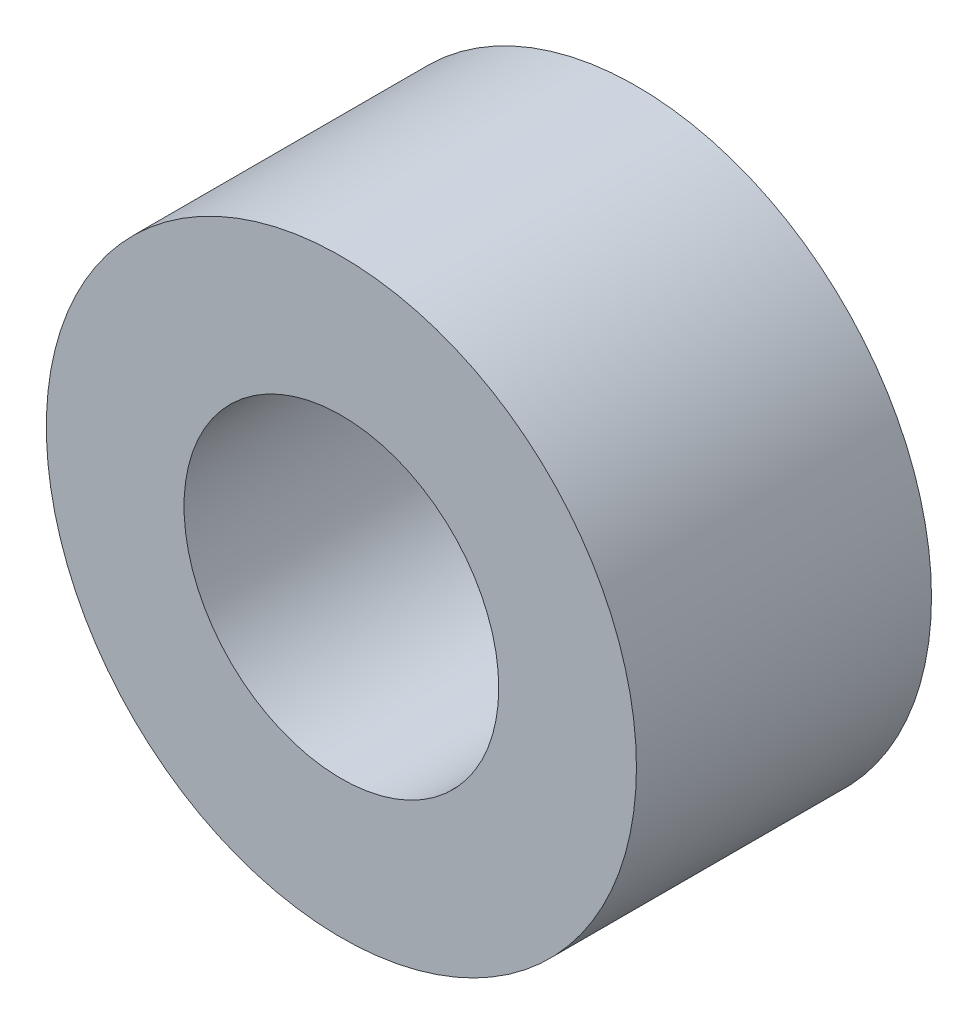
ISO-10303-21;
HEADER;
FILE_DESCRIPTION(('STEP AP214'),'2;1');
FILE_NAME('part.step','',(''),(''),'','','');
FILE_SCHEMA(('AUTOMOTIVE_DESIGN { 1 0 10303 214 1 1 1 1 }'));
ENDSEC;
DATA;
#1=APPLICATION_CONTEXT('core data for automotive mechanical design processes');
#2=APPLICATION_PROTOCOL_DEFINITION('international standard','automotive_design',2000,#1);
#3=PRODUCT_CONTEXT('',#1,'mechanical');
#4=PRODUCT('Part','Part','',(#3));
#5=PRODUCT_RELATED_PRODUCT_CATEGORY('part','',(#4));
#6=PRODUCT_DEFINITION_FORMATION('','',#4);
#7=PRODUCT_DEFINITION_CONTEXT('part definition',#1,'design');
#8=PRODUCT_DEFINITION('design','',#6,#7);
#9=PRODUCT_DEFINITION_SHAPE('','',#8);
#10=(LENGTH_UNIT() NAMED_UNIT(*) SI_UNIT(.MILLI.,.METRE.));
#11=(NAMED_UNIT(*) PLANE_ANGLE_UNIT() SI_UNIT($,.RADIAN.));
#12=(NAMED_UNIT(*) SI_UNIT($,.STERADIAN.) SOLID_ANGLE_UNIT());
#13=UNCERTAINTY_MEASURE_WITH_UNIT(LENGTH_MEASURE(1.E-05),#10,'distance_accuracy_value','');
#14=(GEOMETRIC_REPRESENTATION_CONTEXT(3) GLOBAL_UNCERTAINTY_ASSIGNED_CONTEXT((#13)) GLOBAL_UNIT_ASSIGNED_CONTEXT((#10,
#11,#12)) REPRESENTATION_CONTEXT('',''));
#15=CARTESIAN_POINT('',(0.,0.,0.));
#16=DIRECTION('',(0.,0.,1.));
#17=DIRECTION('',(1.,0.,0.));
#18=AXIS2_PLACEMENT_3D('',#15,#16,#17);
#19=CARTESIAN_POINT('',(0.,0.,3.));
#20=DIRECTION('',(0.,0.,1.));
#21=DIRECTION('',(1.,0.,0.));
#22=AXIS2_PLACEMENT_3D('',#19,#20,#21);
#23=PLANE('',#22);
#24=CARTESIAN_POINT('',(0.,0.,3.));
#25=DIRECTION('',(0.,0.,1.));
#26=DIRECTION('',(1.,0.,0.));
#27=AXIS2_PLACEMENT_3D('',#24,#25,#26);
#28=CIRCLE('',#27,3.);
#29=CARTESIAN_POINT('',(3.,0.,3.));
#30=VERTEX_POINT('',#29);
#31=EDGE_CURVE('E10',#30,#30,#28,.T.);
#32=ORIENTED_EDGE('',*,*,#31,.T.);
#33=EDGE_LOOP('',(#32));
#34=FACE_BOUND('',#33,.T.);
#35=CARTESIAN_POINT('',(0.,0.,3.));
#36=DIRECTION('',(0.,0.,1.));
#37=DIRECTION('',(1.,0.,0.));
#38=AXIS2_PLACEMENT_3D('',#35,#36,#37);
#39=CIRCLE('',#38,1.6);
#40=CARTESIAN_POINT('',(1.6,0.,3.));
#41=VERTEX_POINT('',#40);
#42=EDGE_CURVE('E50',#41,#41,#39,.T.);
#43=ORIENTED_EDGE('',*,*,#42,.F.);
#44=EDGE_LOOP('',(#43));
#45=FACE_BOUND('',#44,.T.);
#46=ADVANCED_FACE('F37',(#34,#45),#23,.T.);
#47=CARTESIAN_POINT('',(0.,0.,0.));
#48=DIRECTION('',(0.,0.,1.));
#49=DIRECTION('',(1.,0.,0.));
#50=AXIS2_PLACEMENT_3D('',#47,#48,#49);
#51=PLANE('',#50);
#52=CARTESIAN_POINT('',(0.,0.,0.));
#53=DIRECTION('',(0.,0.,1.));
#54=DIRECTION('',(1.,0.,0.));
#55=AXIS2_PLACEMENT_3D('',#52,#53,#54);
#56=CIRCLE('',#55,3.);
#57=CARTESIAN_POINT('',(3.,0.,0.));
#58=VERTEX_POINT('',#57);
#59=EDGE_CURVE('E41',#58,#58,#56,.T.);
#60=ORIENTED_EDGE('',*,*,#59,.F.);
#61=EDGE_LOOP('',(#60));
#62=FACE_BOUND('',#61,.T.);
#63=CARTESIAN_POINT('',(0.,0.,0.));
#64=DIRECTION('',(0.,0.,1.));
#65=DIRECTION('',(1.,0.,0.));
#66=AXIS2_PLACEMENT_3D('',#63,#64,#65);
#67=CIRCLE('',#66,1.6);
#68=CARTESIAN_POINT('',(1.6,0.,0.));
#69=VERTEX_POINT('',#68);
#70=EDGE_CURVE('E52',#69,#69,#67,.T.);
#71=ORIENTED_EDGE('',*,*,#70,.T.);
#72=EDGE_LOOP('',(#71));
#73=FACE_BOUND('',#72,.T.);
#74=ADVANCED_FACE('F64',(#62,#73),#51,.F.);
#75=CARTESIAN_POINT('',(0.,0.,3.));
#76=DIRECTION('',(0.,0.,-1.));
#77=DIRECTION('',(-1.,0.,0.));
#78=AXIS2_PLACEMENT_3D('',#75,#76,#77);
#79=CYLINDRICAL_SURFACE('',#78,3.);
#80=ORIENTED_EDGE('',*,*,#31,.F.);
#81=EDGE_LOOP('',(#80));
#82=FACE_BOUND('',#81,.T.);
#83=ORIENTED_EDGE('',*,*,#59,.T.);
#84=EDGE_LOOP('',(#83));
#85=FACE_BOUND('',#84,.T.);
#86=ADVANCED_FACE('F39',(#82,#85),#79,.T.);
#87=CARTESIAN_POINT('',(0.,0.,3.));
#88=DIRECTION('',(0.,0.,-1.));
#89=DIRECTION('',(-1.,0.,0.));
#90=AXIS2_PLACEMENT_3D('',#87,#88,#89);
#91=CYLINDRICAL_SURFACE('',#90,1.6);
#92=ORIENTED_EDGE('',*,*,#42,.T.);
#93=EDGE_LOOP('',(#92));
#94=FACE_BOUND('',#93,.T.);
#95=ORIENTED_EDGE('',*,*,#70,.F.);
#96=EDGE_LOOP('',(#95));
#97=FACE_BOUND('',#96,.T.);
#98=ADVANCED_FACE('F60',(#94,#97),#91,.F.);
#99=CLOSED_SHELL('',(#46,#74,#86,#98));
#100=MANIFOLD_SOLID_BREP('B2',#99);
#101=ADVANCED_BREP_SHAPE_REPRESENTATION('',(#18,#100),#14);
#102=SHAPE_DEFINITION_REPRESENTATION(#9,#101);
ENDSEC;
END-ISO-10303-21;
